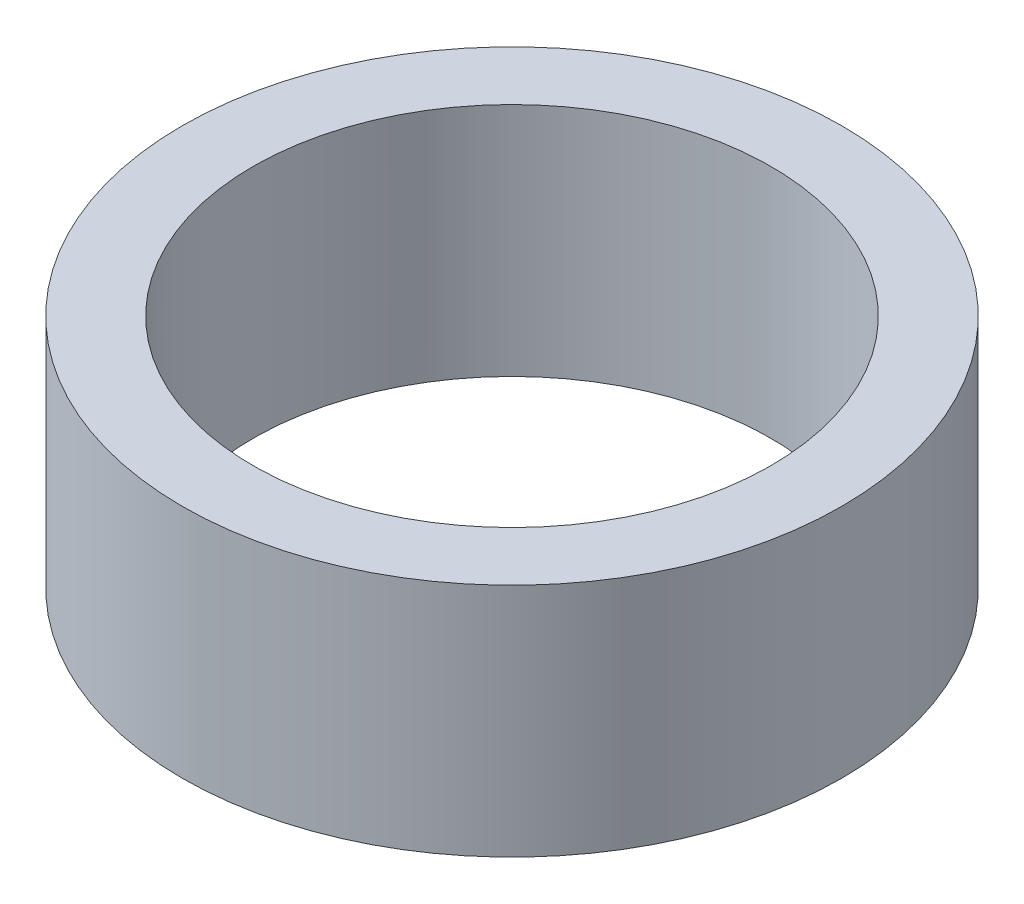
ISO-10303-21;
HEADER;
FILE_DESCRIPTION(('STEP AP214'),'2;1');
FILE_NAME('part.step','',(''),(''),'','','');
FILE_SCHEMA(('AUTOMOTIVE_DESIGN { 1 0 10303 214 1 1 1 1 }'));
ENDSEC;
DATA;
#1=APPLICATION_CONTEXT('core data for automotive mechanical design processes');
#2=APPLICATION_PROTOCOL_DEFINITION('international standard','automotive_design',2000,#1);
#3=PRODUCT_CONTEXT('',#1,'mechanical');
#4=PRODUCT('Part','Part','',(#3));
#5=PRODUCT_RELATED_PRODUCT_CATEGORY('part','',(#4));
#6=PRODUCT_DEFINITION_FORMATION('','',#4);
#7=PRODUCT_DEFINITION_CONTEXT('part definition',#1,'design');
#8=PRODUCT_DEFINITION('design','',#6,#7);
#9=PRODUCT_DEFINITION_SHAPE('','',#8);
#10=(LENGTH_UNIT() NAMED_UNIT(*) SI_UNIT(.MILLI.,.METRE.));
#11=(NAMED_UNIT(*) PLANE_ANGLE_UNIT() SI_UNIT($,.RADIAN.));
#12=(NAMED_UNIT(*) SI_UNIT($,.STERADIAN.) SOLID_ANGLE_UNIT());
#13=UNCERTAINTY_MEASURE_WITH_UNIT(LENGTH_MEASURE(1.E-05),#10,'distance_accuracy_value','');
#14=(GEOMETRIC_REPRESENTATION_CONTEXT(3) GLOBAL_UNCERTAINTY_ASSIGNED_CONTEXT((#13)) GLOBAL_UNIT_ASSIGNED_CONTEXT((#10,
#11,#12)) REPRESENTATION_CONTEXT('',''));
#15=CARTESIAN_POINT('',(0.,0.,0.));
#16=DIRECTION('',(0.,0.,1.));
#17=DIRECTION('',(1.,0.,0.));
#18=AXIS2_PLACEMENT_3D('',#15,#16,#17);
#19=CARTESIAN_POINT('',(115.72802990488,12.3994949366095,-107.796319891291));
#20=DIRECTION('',(0.,-1.,0.));
#21=DIRECTION('',(0.,0.,-1.));
#22=AXIS2_PLACEMENT_3D('',#19,#20,#21);
#23=CYLINDRICAL_SURFACE('',#22,3.49999999999926);
#24=CARTESIAN_POINT('',(115.72802990488,0.,-107.796319891291));
#25=DIRECTION('',(0.,1.,0.));
#26=DIRECTION('',(0.,0.,1.));
#27=AXIS2_PLACEMENT_3D('',#24,#25,#26);
#28=CIRCLE('',#27,3.49999999999926);
#29=CARTESIAN_POINT('',(115.72802990488,0.,-104.296319891292));
#30=VERTEX_POINT('',#29);
#31=EDGE_CURVE('E49',#30,#30,#28,.T.);
#32=ORIENTED_EDGE('',*,*,#31,.T.);
#33=EDGE_LOOP('',(#32));
#34=FACE_BOUND('',#33,.T.);
#35=CARTESIAN_POINT('',(115.72802990488,2.4999999999999,-107.796319891291));
#36=DIRECTION('',(0.,1.,0.));
#37=DIRECTION('',(0.,0.,1.));
#38=AXIS2_PLACEMENT_3D('',#35,#36,#37);
#39=CIRCLE('',#38,3.49999999999926);
#40=CARTESIAN_POINT('',(115.72802990488,2.49999999999989,-104.296319891292));
#41=VERTEX_POINT('',#40);
#42=EDGE_CURVE('E53',#41,#41,#39,.T.);
#43=ORIENTED_EDGE('',*,*,#42,.F.);
#44=EDGE_LOOP('',(#43));
#45=FACE_BOUND('',#44,.T.);
#46=ADVANCED_FACE('F46',(#34,#45),#23,.T.);
#47=CARTESIAN_POINT('',(115.72802990488,0.,-107.796319891291));
#48=DIRECTION('',(0.,1.,0.));
#49=DIRECTION('',(0.,0.,1.));
#50=AXIS2_PLACEMENT_3D('',#47,#48,#49);
#51=PLANE('',#50);
#52=ORIENTED_EDGE('',*,*,#31,.F.);
#53=EDGE_LOOP('',(#52));
#54=FACE_BOUND('',#53,.T.);
#55=CARTESIAN_POINT('',(115.72802990488,0.,-107.796319891291));
#56=DIRECTION('',(0.,1.,0.));
#57=DIRECTION('',(0.,0.,1.));
#58=AXIS2_PLACEMENT_3D('',#55,#56,#57);
#59=CIRCLE('',#58,2.75000000000002);
#60=CARTESIAN_POINT('',(115.72802990488,0.,-105.046319891291));
#61=VERTEX_POINT('',#60);
#62=EDGE_CURVE('E59',#61,#61,#59,.T.);
#63=ORIENTED_EDGE('',*,*,#62,.T.);
#64=EDGE_LOOP('',(#63));
#65=FACE_BOUND('',#64,.T.);
#66=ADVANCED_FACE('F68',(#54,#65),#51,.F.);
#67=CARTESIAN_POINT('',(115.72802990488,12.3994949366095,-107.796319891291));
#68=DIRECTION('',(0.,-1.,0.));
#69=DIRECTION('',(0.,0.,-1.));
#70=AXIS2_PLACEMENT_3D('',#67,#68,#69);
#71=CYLINDRICAL_SURFACE('',#70,2.75000000000002);
#72=ORIENTED_EDGE('',*,*,#62,.F.);
#73=EDGE_LOOP('',(#72));
#74=FACE_BOUND('',#73,.T.);
#75=CARTESIAN_POINT('',(115.728029904882,2.49999999999989,-107.796319891289));
#76=DIRECTION('',(0.,1.,0.));
#77=DIRECTION('',(-0.327748512769107,0.,-0.944765003785406));
#78=AXIS2_PLACEMENT_3D('',#75,#76,#77);
#79=CIRCLE('',#78,2.7499999999683);
#80=CARTESIAN_POINT('',(114.826721494777,2.49999999999989,-110.394423651669));
#81=VERTEX_POINT('',#80);
#82=EDGE_CURVE('E11',#81,#81,#79,.T.);
#83=ORIENTED_EDGE('',*,*,#82,.T.);
#84=EDGE_LOOP('',(#83));
#85=FACE_BOUND('',#84,.T.);
#86=ADVANCED_FACE('F70',(#74,#85),#71,.F.);
#87=CARTESIAN_POINT('',(110.929432671304,2.4999999999999,-112.180777051519));
#88=DIRECTION('',(0.,1.,0.));
#89=DIRECTION('',(-0.327748512769107,0.,-0.944765003785406));
#90=AXIS2_PLACEMENT_3D('',#87,#88,#89);
#91=PLANE('',#90);
#92=ORIENTED_EDGE('',*,*,#82,.F.);
#93=EDGE_LOOP('',(#92));
#94=FACE_BOUND('',#93,.T.);
#95=ORIENTED_EDGE('',*,*,#42,.T.);
#96=EDGE_LOOP('',(#95));
#97=FACE_BOUND('',#96,.T.);
#98=ADVANCED_FACE('F75',(#94,#97),#91,.T.);
#99=CLOSED_SHELL('',(#46,#66,#86,#98));
#100=MANIFOLD_SOLID_BREP('B2',#99);
#101=ADVANCED_BREP_SHAPE_REPRESENTATION('',(#18,#100),#14);
#102=SHAPE_DEFINITION_REPRESENTATION(#9,#101);
ENDSEC;
END-ISO-10303-21;
